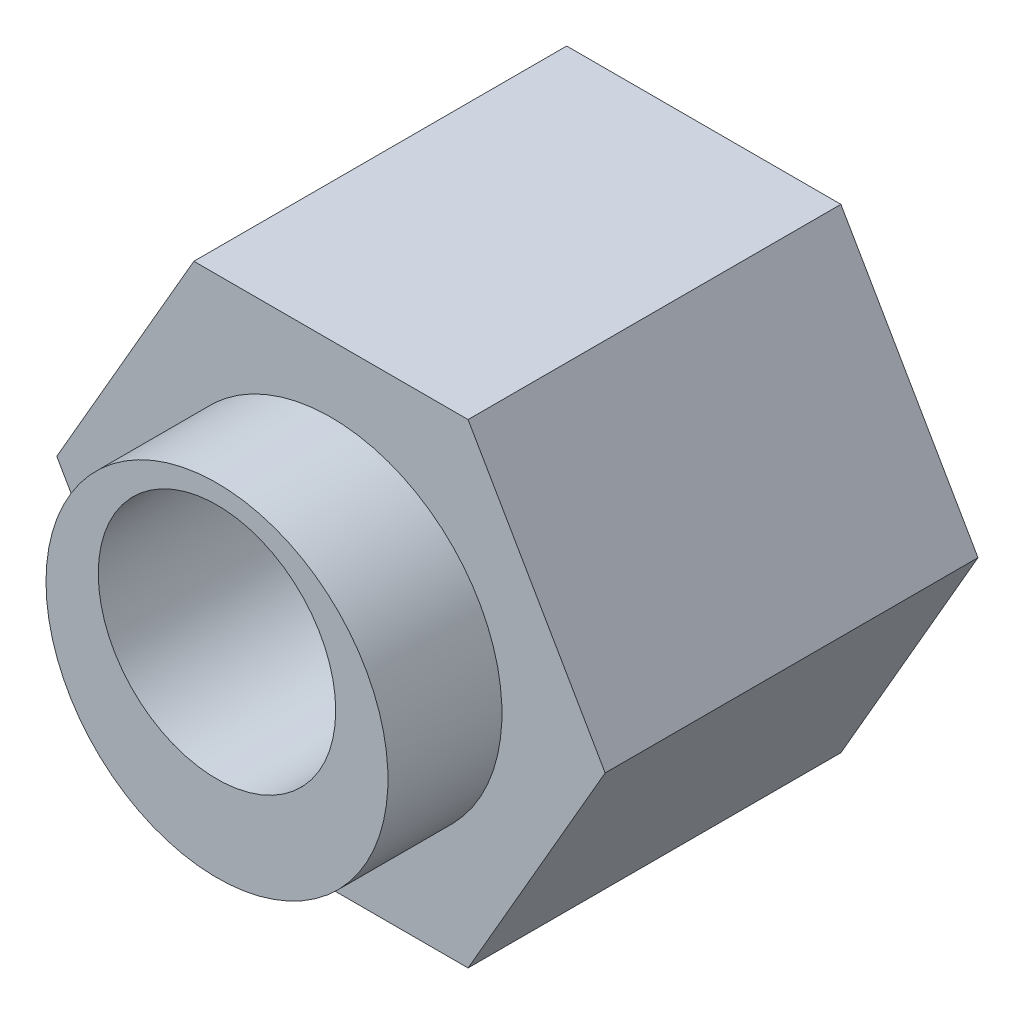
ISO-10303-21;
HEADER;
FILE_DESCRIPTION(('STEP AP214'),'2;1');
FILE_NAME('part.step','',(''),(''),'','','');
FILE_SCHEMA(('AUTOMOTIVE_DESIGN { 1 0 10303 214 1 1 1 1 }'));
ENDSEC;
DATA;
#1=APPLICATION_CONTEXT('core data for automotive mechanical design processes');
#2=APPLICATION_PROTOCOL_DEFINITION('international standard','automotive_design',2000,#1);
#3=PRODUCT_CONTEXT('',#1,'mechanical');
#4=PRODUCT('Part','Part','',(#3));
#5=PRODUCT_RELATED_PRODUCT_CATEGORY('part','',(#4));
#6=PRODUCT_DEFINITION_FORMATION('','',#4);
#7=PRODUCT_DEFINITION_CONTEXT('part definition',#1,'design');
#8=PRODUCT_DEFINITION('design','',#6,#7);
#9=PRODUCT_DEFINITION_SHAPE('','',#8);
#10=(LENGTH_UNIT() NAMED_UNIT(*) SI_UNIT(.MILLI.,.METRE.));
#11=(NAMED_UNIT(*) PLANE_ANGLE_UNIT() SI_UNIT($,.RADIAN.));
#12=(NAMED_UNIT(*) SI_UNIT($,.STERADIAN.) SOLID_ANGLE_UNIT());
#13=UNCERTAINTY_MEASURE_WITH_UNIT(LENGTH_MEASURE(1.E-05),#10,'distance_accuracy_value','');
#14=(GEOMETRIC_REPRESENTATION_CONTEXT(3) GLOBAL_UNCERTAINTY_ASSIGNED_CONTEXT((#13)) GLOBAL_UNIT_ASSIGNED_CONTEXT((#10,
#11,#12)) REPRESENTATION_CONTEXT('',''));
#15=CARTESIAN_POINT('',(0.,0.,0.));
#16=DIRECTION('',(0.,0.,1.));
#17=DIRECTION('',(1.,0.,0.));
#18=AXIS2_PLACEMENT_3D('',#15,#16,#17);
#19=CARTESIAN_POINT('',(0.,0.7,0.45));
#20=DIRECTION('',(0.,0.,-1.));
#21=DIRECTION('',(-1.,0.,0.));
#22=AXIS2_PLACEMENT_3D('',#19,#20,#21);
#23=PLANE('',#22);
#24=CARTESIAN_POINT('',(0.,0.7,0.45));
#25=DIRECTION('',(0.,0.,-1.));
#26=DIRECTION('',(-1.,0.,0.));
#27=AXIS2_PLACEMENT_3D('',#24,#25,#26);
#28=CIRCLE('',#27,3.6);
#29=CARTESIAN_POINT('',(-3.6,0.7,0.45));
#30=VERTEX_POINT('',#29);
#31=EDGE_CURVE('E20',#30,#30,#28,.T.);
#32=ORIENTED_EDGE('',*,*,#31,.F.);
#33=EDGE_LOOP('',(#32));
#34=FACE_BOUND('',#33,.T.);
#35=DIRECTION('',(0.5,-0.866025403784439,0.));
#36=VECTOR('',#35,1.);
#37=CARTESIAN_POINT('',(-5.77350269189626,0.,0.45));
#38=LINE('',#37,#36);
#39=CARTESIAN_POINT('',(-5.77350269189626,0.,0.45));
#40=VERTEX_POINT('',#39);
#41=CARTESIAN_POINT('',(-2.88675134594813,-5.,0.45));
#42=VERTEX_POINT('',#41);
#43=EDGE_CURVE('E68',#40,#42,#38,.T.);
#44=ORIENTED_EDGE('',*,*,#43,.F.);
#45=DIRECTION('',(-0.500000000000001,-0.866025403784438,0.));
#46=VECTOR('',#45,1.);
#47=CARTESIAN_POINT('',(-2.88675134594812,5.,0.45));
#48=LINE('',#47,#46);
#49=CARTESIAN_POINT('',(-2.88675134594813,5.,0.45));
#50=VERTEX_POINT('',#49);
#51=EDGE_CURVE('E75',#50,#40,#48,.T.);
#52=ORIENTED_EDGE('',*,*,#51,.F.);
#53=DIRECTION('',(1.,0.,0.));
#54=VECTOR('',#53,1.);
#55=CARTESIAN_POINT('',(2.88675134594813,5.,0.45));
#56=LINE('',#55,#54);
#57=CARTESIAN_POINT('',(2.88675134594813,5.,0.45));
#58=VERTEX_POINT('',#57);
#59=EDGE_CURVE('E124',#58,#50,#56,.F.);
#60=ORIENTED_EDGE('',*,*,#59,.F.);
#61=DIRECTION('',(-0.5,0.866025403784439,0.));
#62=VECTOR('',#61,1.);
#63=CARTESIAN_POINT('',(5.77350269189626,0.,0.45));
#64=LINE('',#63,#62);
#65=CARTESIAN_POINT('',(5.77350269189626,0.,0.45));
#66=VERTEX_POINT('',#65);
#67=EDGE_CURVE('E129',#66,#58,#64,.T.);
#68=ORIENTED_EDGE('',*,*,#67,.F.);
#69=DIRECTION('',(0.500000000000001,0.866025403784438,0.));
#70=VECTOR('',#69,1.);
#71=CARTESIAN_POINT('',(2.88675134594812,-5.,0.45));
#72=LINE('',#71,#70);
#73=CARTESIAN_POINT('',(2.88675134594813,-5.,0.45));
#74=VERTEX_POINT('',#73);
#75=EDGE_CURVE('E134',#74,#66,#72,.T.);
#76=ORIENTED_EDGE('',*,*,#75,.F.);
#77=DIRECTION('',(1.,0.,0.));
#78=VECTOR('',#77,1.);
#79=CARTESIAN_POINT('',(-2.88675134594813,-5.,0.45));
#80=LINE('',#79,#78);
#81=EDGE_CURVE('E89',#42,#74,#80,.T.);
#82=ORIENTED_EDGE('',*,*,#81,.F.);
#83=EDGE_LOOP('',(#44,#52,#60,#68,#76,#82));
#84=FACE_BOUND('',#83,.T.);
#85=ADVANCED_FACE('F17',(#34,#84),#23,.T.);
#86=CARTESIAN_POINT('',(0.,0.7,0.45));
#87=DIRECTION('',(0.,0.,-1.));
#88=DIRECTION('',(-1.,0.,0.));
#89=AXIS2_PLACEMENT_3D('',#86,#87,#88);
#90=CYLINDRICAL_SURFACE('',#89,3.6);
#91=ORIENTED_EDGE('',*,*,#31,.T.);
#92=EDGE_LOOP('',(#91));
#93=FACE_BOUND('',#92,.T.);
#94=CARTESIAN_POINT('',(0.,0.7,0.0500000000442924));
#95=DIRECTION('',(0.,0.,1.));
#96=DIRECTION('',(1.,0.,0.));
#97=AXIS2_PLACEMENT_3D('',#94,#95,#96);
#98=CIRCLE('',#97,3.60000000000582);
#99=CARTESIAN_POINT('',(3.60000000000582,0.7,0.0500000000442924));
#100=VERTEX_POINT('',#99);
#101=EDGE_CURVE('E95',#100,#100,#98,.F.);
#102=ORIENTED_EDGE('',*,*,#101,.F.);
#103=EDGE_LOOP('',(#102));
#104=FACE_BOUND('',#103,.T.);
#105=ADVANCED_FACE('F295',(#93,#104),#90,.T.);
#106=CARTESIAN_POINT('',(-2.88675134594812,5.,-0.0499999999999997));
#107=DIRECTION('',(-0.866025403784438,0.500000000000001,0.));
#108=DIRECTION('',(-0.500000000000001,-0.866025403784438,0.));
#109=AXIS2_PLACEMENT_3D('',#106,#107,#108);
#110=PLANE('',#109);
#111=DIRECTION('',(0.,0.,1.));
#112=VECTOR('',#111,1.);
#113=CARTESIAN_POINT('',(-5.77350269189626,0.,-0.0499999999999997));
#114=LINE('',#113,#112);
#115=CARTESIAN_POINT('',(-5.77350269189626,0.,8.3));
#116=VERTEX_POINT('',#115);
#117=EDGE_CURVE('E78',#116,#40,#114,.F.);
#118=ORIENTED_EDGE('',*,*,#117,.F.);
#119=DIRECTION('',(-0.500000000000001,-0.866025403784438,0.));
#120=VECTOR('',#119,1.);
#121=CARTESIAN_POINT('',(-2.88675134594812,5.,8.3));
#122=LINE('',#121,#120);
#123=CARTESIAN_POINT('',(-2.88675134594813,5.,8.3));
#124=VERTEX_POINT('',#123);
#125=EDGE_CURVE('E97',#124,#116,#122,.T.);
#126=ORIENTED_EDGE('',*,*,#125,.F.);
#127=DIRECTION('',(0.,0.,1.));
#128=VECTOR('',#127,1.);
#129=CARTESIAN_POINT('',(-2.88675134594813,5.,-0.0499999999999997));
#130=LINE('',#129,#128);
#131=EDGE_CURVE('E80',#50,#124,#130,.T.);
#132=ORIENTED_EDGE('',*,*,#131,.F.);
#133=ORIENTED_EDGE('',*,*,#51,.T.);
#134=EDGE_LOOP('',(#118,#126,#132,#133));
#135=FACE_BOUND('',#134,.T.);
#136=ADVANCED_FACE('F76',(#135),#110,.T.);
#137=CARTESIAN_POINT('',(-5.77350269189626,0.,-0.0499999999999997));
#138=DIRECTION('',(-0.866025403784439,-0.5,0.));
#139=DIRECTION('',(0.5,-0.866025403784439,0.));
#140=AXIS2_PLACEMENT_3D('',#137,#138,#139);
#141=PLANE('',#140);
#142=DIRECTION('',(0.,0.,-1.));
#143=VECTOR('',#142,1.);
#144=CARTESIAN_POINT('',(-2.88675134594813,-5.,-0.0499999999999997));
#145=LINE('',#144,#143);
#146=CARTESIAN_POINT('',(-2.88675134594813,-5.,8.3));
#147=VERTEX_POINT('',#146);
#148=EDGE_CURVE('E90',#147,#42,#145,.T.);
#149=ORIENTED_EDGE('',*,*,#148,.F.);
#150=DIRECTION('',(0.5,-0.866025403784439,0.));
#151=VECTOR('',#150,1.);
#152=CARTESIAN_POINT('',(-5.77350269189626,0.,8.3));
#153=LINE('',#152,#151);
#154=EDGE_CURVE('E85',#116,#147,#153,.T.);
#155=ORIENTED_EDGE('',*,*,#154,.F.);
#156=ORIENTED_EDGE('',*,*,#117,.T.);
#157=ORIENTED_EDGE('',*,*,#43,.T.);
#158=EDGE_LOOP('',(#149,#155,#156,#157));
#159=FACE_BOUND('',#158,.T.);
#160=ADVANCED_FACE('F84',(#159),#141,.T.);
#161=CARTESIAN_POINT('',(-2.88675134594813,-5.,-0.0499999999999997));
#162=DIRECTION('',(0.,-1.,0.));
#163=DIRECTION('',(0.,0.,-1.));
#164=AXIS2_PLACEMENT_3D('',#161,#162,#163);
#165=PLANE('',#164);
#166=DIRECTION('',(0.,0.,1.));
#167=VECTOR('',#166,1.);
#168=CARTESIAN_POINT('',(2.88675134594812,-5.,-0.0499999999999997));
#169=LINE('',#168,#167);
#170=CARTESIAN_POINT('',(2.88675134594813,-5.,8.3));
#171=VERTEX_POINT('',#170);
#172=EDGE_CURVE('E136',#171,#74,#169,.F.);
#173=ORIENTED_EDGE('',*,*,#172,.F.);
#174=DIRECTION('',(1.,0.,0.));
#175=VECTOR('',#174,1.);
#176=CARTESIAN_POINT('',(0.,-5.,8.3));
#177=LINE('',#176,#175);
#178=EDGE_CURVE('E119',#147,#171,#177,.T.);
#179=ORIENTED_EDGE('',*,*,#178,.F.);
#180=ORIENTED_EDGE('',*,*,#148,.T.);
#181=ORIENTED_EDGE('',*,*,#81,.T.);
#182=EDGE_LOOP('',(#173,#179,#180,#181));
#183=FACE_BOUND('',#182,.T.);
#184=ADVANCED_FACE('F140',(#183),#165,.T.);
#185=CARTESIAN_POINT('',(2.88675134594812,-5.,-0.0499999999999997));
#186=DIRECTION('',(0.866025403784438,-0.500000000000001,0.));
#187=DIRECTION('',(0.500000000000001,0.866025403784438,0.));
#188=AXIS2_PLACEMENT_3D('',#185,#186,#187);
#189=PLANE('',#188);
#190=DIRECTION('',(0.,0.,1.));
#191=VECTOR('',#190,1.);
#192=CARTESIAN_POINT('',(5.77350269189626,0.,-0.0499999999999997));
#193=LINE('',#192,#191);
#194=CARTESIAN_POINT('',(5.77350269189626,0.,8.3));
#195=VERTEX_POINT('',#194);
#196=EDGE_CURVE('E131',#195,#66,#193,.F.);
#197=ORIENTED_EDGE('',*,*,#196,.F.);
#198=DIRECTION('',(0.500000000000001,0.866025403784438,0.));
#199=VECTOR('',#198,1.);
#200=CARTESIAN_POINT('',(2.88675134594812,-5.,8.3));
#201=LINE('',#200,#199);
#202=EDGE_CURVE('E114',#171,#195,#201,.T.);
#203=ORIENTED_EDGE('',*,*,#202,.F.);
#204=ORIENTED_EDGE('',*,*,#172,.T.);
#205=ORIENTED_EDGE('',*,*,#75,.T.);
#206=EDGE_LOOP('',(#197,#203,#204,#205));
#207=FACE_BOUND('',#206,.T.);
#208=ADVANCED_FACE('F145',(#207),#189,.T.);
#209=CARTESIAN_POINT('',(5.77350269189626,0.,-0.0499999999999997));
#210=DIRECTION('',(0.866025403784439,0.5,0.));
#211=DIRECTION('',(-0.5,0.866025403784439,0.));
#212=AXIS2_PLACEMENT_3D('',#209,#210,#211);
#213=PLANE('',#212);
#214=DIRECTION('',(0.,0.,1.));
#215=VECTOR('',#214,1.);
#216=CARTESIAN_POINT('',(2.88675134594813,5.,-0.0499999999999997));
#217=LINE('',#216,#215);
#218=CARTESIAN_POINT('',(2.88675134594813,5.,8.3));
#219=VERTEX_POINT('',#218);
#220=EDGE_CURVE('E126',#219,#58,#217,.F.);
#221=ORIENTED_EDGE('',*,*,#220,.F.);
#222=DIRECTION('',(-0.5,0.866025403784439,0.));
#223=VECTOR('',#222,1.);
#224=CARTESIAN_POINT('',(5.77350269189626,0.,8.3));
#225=LINE('',#224,#223);
#226=EDGE_CURVE('E35',#195,#219,#225,.T.);
#227=ORIENTED_EDGE('',*,*,#226,.F.);
#228=ORIENTED_EDGE('',*,*,#196,.T.);
#229=ORIENTED_EDGE('',*,*,#67,.T.);
#230=EDGE_LOOP('',(#221,#227,#228,#229));
#231=FACE_BOUND('',#230,.T.);
#232=ADVANCED_FACE('F148',(#231),#213,.T.);
#233=CARTESIAN_POINT('',(2.88675134594813,5.,-0.0499999999999997));
#234=DIRECTION('',(0.,1.,0.));
#235=DIRECTION('',(0.,0.,1.));
#236=AXIS2_PLACEMENT_3D('',#233,#234,#235);
#237=PLANE('',#236);
#238=ORIENTED_EDGE('',*,*,#131,.T.);
#239=DIRECTION('',(1.,0.,0.));
#240=VECTOR('',#239,1.);
#241=CARTESIAN_POINT('',(0.,5.,8.3));
#242=LINE('',#241,#240);
#243=EDGE_CURVE('E109',#219,#124,#242,.F.);
#244=ORIENTED_EDGE('',*,*,#243,.F.);
#245=ORIENTED_EDGE('',*,*,#220,.T.);
#246=ORIENTED_EDGE('',*,*,#59,.T.);
#247=EDGE_LOOP('',(#238,#244,#245,#246));
#248=FACE_BOUND('',#247,.T.);
#249=ADVANCED_FACE('F150',(#248),#237,.T.);
#250=CARTESIAN_POINT('',(0.,0.7,0.0500000000442924));
#251=DIRECTION('',(0.,0.,1.));
#252=DIRECTION('',(1.,0.,0.));
#253=AXIS2_PLACEMENT_3D('',#250,#251,#252);
#254=CONICAL_SURFACE('',#253,3.60000000000582,0.785398163397448);
#255=CARTESIAN_POINT('',(0.,0.7,-0.049999999987449));
#256=DIRECTION('',(0.,0.,1.));
#257=DIRECTION('',(1.,0.,0.));
#258=AXIS2_PLACEMENT_3D('',#255,#256,#257);
#259=CIRCLE('',#258,3.49999999997408);
#260=CARTESIAN_POINT('',(3.49999999997408,0.7,-0.049999999987449));
#261=VERTEX_POINT('',#260);
#262=EDGE_CURVE('E107',#261,#261,#259,.T.);
#263=ORIENTED_EDGE('',*,*,#262,.T.);
#264=EDGE_LOOP('',(#263));
#265=FACE_BOUND('',#264,.T.);
#266=ORIENTED_EDGE('',*,*,#101,.T.);
#267=EDGE_LOOP('',(#266));
#268=FACE_BOUND('',#267,.T.);
#269=ADVANCED_FACE('F152',(#265,#268),#254,.T.);
#270=CARTESIAN_POINT('',(0.,0.,8.3));
#271=DIRECTION('',(0.,0.,1.));
#272=DIRECTION('',(1.,0.,0.));
#273=AXIS2_PLACEMENT_3D('',#270,#271,#272);
#274=PLANE('',#273);
#275=ORIENTED_EDGE('',*,*,#226,.T.);
#276=ORIENTED_EDGE('',*,*,#243,.T.);
#277=ORIENTED_EDGE('',*,*,#125,.T.);
#278=ORIENTED_EDGE('',*,*,#154,.T.);
#279=ORIENTED_EDGE('',*,*,#178,.T.);
#280=ORIENTED_EDGE('',*,*,#202,.T.);
#281=EDGE_LOOP('',(#275,#276,#277,#278,#279,#280));
#282=FACE_BOUND('',#281,.T.);
#283=CARTESIAN_POINT('',(0.,0.,8.3));
#284=DIRECTION('',(0.,0.,-1.));
#285=DIRECTION('',(-1.,0.,0.));
#286=AXIS2_PLACEMENT_3D('',#283,#284,#285);
#287=CIRCLE('',#286,3.6);
#288=CARTESIAN_POINT('',(-3.6,0.,8.3));
#289=VERTEX_POINT('',#288);
#290=EDGE_CURVE('E105',#289,#289,#287,.F.);
#291=ORIENTED_EDGE('',*,*,#290,.F.);
#292=EDGE_LOOP('',(#291));
#293=FACE_BOUND('',#292,.T.);
#294=ADVANCED_FACE('F159',(#282,#293),#274,.T.);
#295=CARTESIAN_POINT('',(0.,0.,-0.0499999999999997));
#296=DIRECTION('',(0.,0.,1.));
#297=DIRECTION('',(1.,0.,0.));
#298=AXIS2_PLACEMENT_3D('',#295,#296,#297);
#299=PLANE('',#298);
#300=ORIENTED_EDGE('',*,*,#262,.F.);
#301=EDGE_LOOP('',(#300));
#302=FACE_BOUND('',#301,.T.);
#303=CARTESIAN_POINT('',(0.,0.7,-0.0500000000442924));
#304=DIRECTION('',(0.,0.,-1.));
#305=DIRECTION('',(-1.,0.,0.));
#306=AXIS2_PLACEMENT_3D('',#303,#304,#305);
#307=CIRCLE('',#306,2.59999999997262);
#308=CARTESIAN_POINT('',(-2.59999999997262,0.7,-0.0500000000442924));
#309=VERTEX_POINT('',#308);
#310=EDGE_CURVE('E102',#309,#309,#307,.F.);
#311=ORIENTED_EDGE('',*,*,#310,.T.);
#312=EDGE_LOOP('',(#311));
#313=FACE_BOUND('',#312,.T.);
#314=ADVANCED_FACE('F182',(#302,#313),#299,.F.);
#315=CARTESIAN_POINT('',(0.,0.,10.7));
#316=DIRECTION('',(0.,0.,-1.));
#317=DIRECTION('',(-1.,0.,0.));
#318=AXIS2_PLACEMENT_3D('',#315,#316,#317);
#319=CYLINDRICAL_SURFACE('',#318,3.6);
#320=CARTESIAN_POINT('',(0.,0.,10.7));
#321=DIRECTION('',(0.,0.,-1.));
#322=DIRECTION('',(-1.,0.,0.));
#323=AXIS2_PLACEMENT_3D('',#320,#321,#322);
#324=CIRCLE('',#323,3.6);
#325=CARTESIAN_POINT('',(-3.6,0.,10.7));
#326=VERTEX_POINT('',#325);
#327=EDGE_CURVE('E99',#326,#326,#324,.F.);
#328=ORIENTED_EDGE('',*,*,#327,.F.);
#329=EDGE_LOOP('',(#328));
#330=FACE_BOUND('',#329,.T.);
#331=ORIENTED_EDGE('',*,*,#290,.T.);
#332=EDGE_LOOP('',(#331));
#333=FACE_BOUND('',#332,.T.);
#334=ADVANCED_FACE('F178',(#330,#333),#319,.T.);
#335=CARTESIAN_POINT('',(0.,0.7,-0.0500000000442924));
#336=DIRECTION('',(0.,0.,-1.));
#337=DIRECTION('',(-1.,0.,0.));
#338=AXIS2_PLACEMENT_3D('',#335,#336,#337);
#339=CONICAL_SURFACE('',#338,2.59999999997262,0.785398163113231);
#340=ORIENTED_EDGE('',*,*,#310,.F.);
#341=EDGE_LOOP('',(#340));
#342=FACE_BOUND('',#341,.T.);
#343=CARTESIAN_POINT('',(0.,0.7,0.0499999999999971));
#344=DIRECTION('',(0.,0.,-1.));
#345=DIRECTION('',(-1.,0.,0.));
#346=AXIS2_PLACEMENT_3D('',#343,#344,#345);
#347=CIRCLE('',#346,2.49999999999999);
#348=CARTESIAN_POINT('',(-2.49999999999999,0.7,0.0499999999999971));
#349=VERTEX_POINT('',#348);
#350=EDGE_CURVE('E26',#349,#349,#347,.F.);
#351=ORIENTED_EDGE('',*,*,#350,.T.);
#352=EDGE_LOOP('',(#351));
#353=FACE_BOUND('',#352,.T.);
#354=ADVANCED_FACE('F170',(#342,#353),#339,.F.);
#355=CARTESIAN_POINT('',(3.6,0.,10.7));
#356=DIRECTION('',(0.,0.,1.));
#357=DIRECTION('',(1.,0.,0.));
#358=AXIS2_PLACEMENT_3D('',#355,#356,#357);
#359=PLANE('',#358);
#360=ORIENTED_EDGE('',*,*,#327,.T.);
#361=EDGE_LOOP('',(#360));
#362=FACE_BOUND('',#361,.T.);
#363=CARTESIAN_POINT('',(0.,0.7,10.7));
#364=DIRECTION('',(0.,0.,-1.));
#365=DIRECTION('',(-1.,0.,0.));
#366=AXIS2_PLACEMENT_3D('',#363,#364,#365);
#367=CIRCLE('',#366,2.49999999999999);
#368=CARTESIAN_POINT('',(-2.49999999999999,0.7,10.7));
#369=VERTEX_POINT('',#368);
#370=EDGE_CURVE('E11',#369,#369,#367,.T.);
#371=ORIENTED_EDGE('',*,*,#370,.T.);
#372=EDGE_LOOP('',(#371));
#373=FACE_BOUND('',#372,.T.);
#374=ADVANCED_FACE('F164',(#362,#373),#359,.T.);
#375=CARTESIAN_POINT('',(0.,0.7,-0.0499999999999997));
#376=DIRECTION('',(0.,0.,-1.));
#377=DIRECTION('',(-1.,0.,0.));
#378=AXIS2_PLACEMENT_3D('',#375,#376,#377);
#379=CYLINDRICAL_SURFACE('',#378,2.49999999999999);
#380=ORIENTED_EDGE('',*,*,#350,.F.);
#381=EDGE_LOOP('',(#380));
#382=FACE_BOUND('',#381,.T.);
#383=ORIENTED_EDGE('',*,*,#370,.F.);
#384=EDGE_LOOP('',(#383));
#385=FACE_BOUND('',#384,.T.);
#386=ADVANCED_FACE('F162',(#382,#385),#379,.F.);
#387=CLOSED_SHELL('',(#85,#105,#136,#160,#184,#208,#232,#249,#269,#294,#314,#334,#354,#374,#386));
#388=MANIFOLD_SOLID_BREP('B1',#387);
#389=ADVANCED_BREP_SHAPE_REPRESENTATION('',(#18,#388),#14);
#390=SHAPE_DEFINITION_REPRESENTATION(#9,#389);
ENDSEC;
END-ISO-10303-21;
